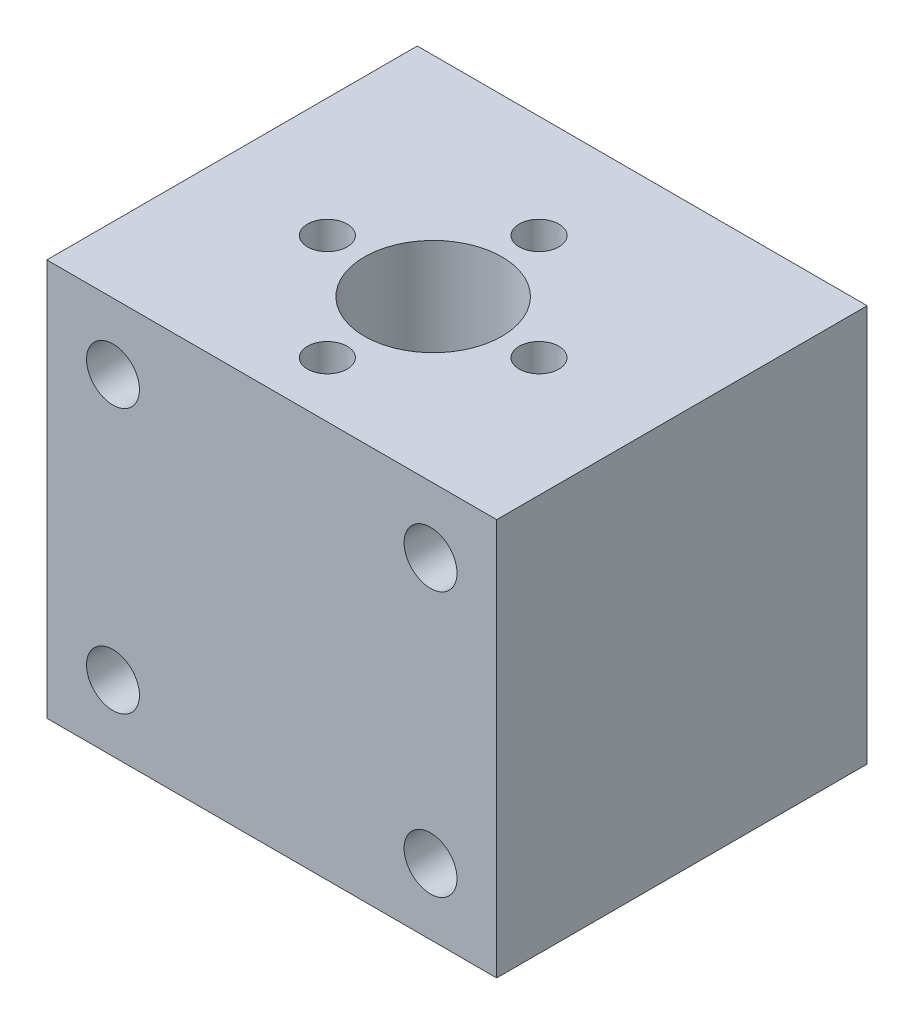
ISO-10303-21;
HEADER;
FILE_DESCRIPTION(('STEP AP214'),'2;1');
FILE_NAME('part.step','',(''),(''),'','','');
FILE_SCHEMA(('AUTOMOTIVE_DESIGN { 1 0 10303 214 1 1 1 1 }'));
ENDSEC;
DATA;
#1=APPLICATION_CONTEXT('core data for automotive mechanical design processes');
#2=APPLICATION_PROTOCOL_DEFINITION('international standard','automotive_design',2000,#1);
#3=PRODUCT_CONTEXT('',#1,'mechanical');
#4=PRODUCT('Part','Part','',(#3));
#5=PRODUCT_RELATED_PRODUCT_CATEGORY('part','',(#4));
#6=PRODUCT_DEFINITION_FORMATION('','',#4);
#7=PRODUCT_DEFINITION_CONTEXT('part definition',#1,'design');
#8=PRODUCT_DEFINITION('design','',#6,#7);
#9=PRODUCT_DEFINITION_SHAPE('','',#8);
#10=(LENGTH_UNIT() NAMED_UNIT(*) SI_UNIT(.MILLI.,.METRE.));
#11=(NAMED_UNIT(*) PLANE_ANGLE_UNIT() SI_UNIT($,.RADIAN.));
#12=(NAMED_UNIT(*) SI_UNIT($,.STERADIAN.) SOLID_ANGLE_UNIT());
#13=UNCERTAINTY_MEASURE_WITH_UNIT(LENGTH_MEASURE(1.E-05),#10,'distance_accuracy_value','');
#14=(GEOMETRIC_REPRESENTATION_CONTEXT(3) GLOBAL_UNCERTAINTY_ASSIGNED_CONTEXT((#13)) GLOBAL_UNIT_ASSIGNED_CONTEXT((#10,
#11,#12)) REPRESENTATION_CONTEXT('',''));
#15=CARTESIAN_POINT('',(0.,0.,0.));
#16=DIRECTION('',(0.,0.,1.));
#17=DIRECTION('',(1.,0.,0.));
#18=AXIS2_PLACEMENT_3D('',#15,#16,#17);
#19=CARTESIAN_POINT('',(-16.3119869221513,9.86014711151592,-28.));
#20=DIRECTION('',(-1.,0.,0.));
#21=DIRECTION('',(0.,-1.,0.));
#22=AXIS2_PLACEMENT_3D('',#19,#20,#21);
#23=PLANE('',#22);
#24=DIRECTION('',(0.,-1.,0.));
#25=VECTOR('',#24,1.);
#26=CARTESIAN_POINT('',(-16.3119869221513,9.86014711151592,0.));
#27=LINE('',#26,#25);
#28=CARTESIAN_POINT('',(-16.3119869221513,9.86014711151592,0.));
#29=VERTEX_POINT('',#28);
#30=CARTESIAN_POINT('',(-16.3119869221512,-20.1398528884841,0.));
#31=VERTEX_POINT('',#30);
#32=EDGE_CURVE('E102',#29,#31,#27,.T.);
#33=ORIENTED_EDGE('',*,*,#32,.F.);
#34=DIRECTION('',(0.,0.,1.));
#35=VECTOR('',#34,1.);
#36=CARTESIAN_POINT('',(-16.3119869221513,9.86014711151592,-28.));
#37=LINE('',#36,#35);
#38=CARTESIAN_POINT('',(-16.3119869221513,9.86014711151592,-28.));
#39=VERTEX_POINT('',#38);
#40=EDGE_CURVE('E11',#39,#29,#37,.T.);
#41=ORIENTED_EDGE('',*,*,#40,.F.);
#42=DIRECTION('',(0.,-1.,0.));
#43=VECTOR('',#42,1.);
#44=CARTESIAN_POINT('',(-16.3119869221513,9.86014711151592,-28.));
#45=LINE('',#44,#43);
#46=CARTESIAN_POINT('',(-16.3119869221512,-20.1398528884841,-28.));
#47=VERTEX_POINT('',#46);
#48=EDGE_CURVE('E95',#39,#47,#45,.T.);
#49=ORIENTED_EDGE('',*,*,#48,.T.);
#50=DIRECTION('',(0.,0.,1.));
#51=VECTOR('',#50,1.);
#52=CARTESIAN_POINT('',(-16.3119869221512,-20.1398528884841,-28.));
#53=LINE('',#52,#51);
#54=EDGE_CURVE('E40',#47,#31,#53,.T.);
#55=ORIENTED_EDGE('',*,*,#54,.T.);
#56=EDGE_LOOP('',(#33,#41,#49,#55));
#57=FACE_BOUND('',#56,.T.);
#58=ADVANCED_FACE('F37',(#57),#23,.T.);
#59=CARTESIAN_POINT('',(-16.3119869221513,9.86014711151592,-28.));
#60=DIRECTION('',(0.,1.,0.));
#61=DIRECTION('',(0.,0.,1.));
#62=AXIS2_PLACEMENT_3D('',#59,#60,#61);
#63=PLANE('',#62);
#64=CARTESIAN_POINT('',(0.688013077848743,9.86014711151592,-4.2));
#65=DIRECTION('',(0.,1.,0.));
#66=DIRECTION('',(0.,0.,1.));
#67=AXIS2_PLACEMENT_3D('',#64,#65,#66);
#68=CIRCLE('',#67,1.5);
#69=CARTESIAN_POINT('',(0.688013077848743,9.86014711151592,-2.7));
#70=VERTEX_POINT('',#69);
#71=EDGE_CURVE('E382',#70,#70,#68,.T.);
#72=ORIENTED_EDGE('',*,*,#71,.F.);
#73=EDGE_LOOP('',(#72));
#74=FACE_BOUND('',#73,.T.);
#75=CARTESIAN_POINT('',(8.68801307784874,9.86014711151592,-12.2));
#76=DIRECTION('',(0.,1.,0.));
#77=DIRECTION('',(0.,0.,1.));
#78=AXIS2_PLACEMENT_3D('',#75,#76,#77);
#79=CIRCLE('',#78,1.5);
#80=CARTESIAN_POINT('',(8.68801307784874,9.86014711151592,-10.7));
#81=VERTEX_POINT('',#80);
#82=EDGE_CURVE('E390',#81,#81,#79,.T.);
#83=ORIENTED_EDGE('',*,*,#82,.F.);
#84=EDGE_LOOP('',(#83));
#85=FACE_BOUND('',#84,.T.);
#86=CARTESIAN_POINT('',(0.688013077848743,9.86014711151592,-20.2));
#87=DIRECTION('',(0.,1.,0.));
#88=DIRECTION('',(0.,0.,1.));
#89=AXIS2_PLACEMENT_3D('',#86,#87,#88);
#90=CIRCLE('',#89,1.5);
#91=CARTESIAN_POINT('',(0.688013077848743,9.86014711151592,-18.7));
#92=VERTEX_POINT('',#91);
#93=EDGE_CURVE('E396',#92,#92,#90,.T.);
#94=ORIENTED_EDGE('',*,*,#93,.F.);
#95=EDGE_LOOP('',(#94));
#96=FACE_BOUND('',#95,.T.);
#97=CARTESIAN_POINT('',(-7.31198692215126,9.86014711151592,-12.2));
#98=DIRECTION('',(0.,1.,0.));
#99=DIRECTION('',(0.,0.,1.));
#100=AXIS2_PLACEMENT_3D('',#97,#98,#99);
#101=CIRCLE('',#100,1.5);
#102=CARTESIAN_POINT('',(-7.31198692215126,9.86014711151592,-10.7));
#103=VERTEX_POINT('',#102);
#104=EDGE_CURVE('E145',#103,#103,#101,.T.);
#105=ORIENTED_EDGE('',*,*,#104,.F.);
#106=EDGE_LOOP('',(#105));
#107=FACE_BOUND('',#106,.T.);
#108=CARTESIAN_POINT('',(0.688013077848743,9.86014711151592,-12.2));
#109=DIRECTION('',(0.,1.,0.));
#110=DIRECTION('',(0.,0.,1.));
#111=AXIS2_PLACEMENT_3D('',#108,#109,#110);
#112=CIRCLE('',#111,5.2);
#113=CARTESIAN_POINT('',(0.688013077848743,9.86014711151592,-7.));
#114=VERTEX_POINT('',#113);
#115=EDGE_CURVE('E136',#114,#114,#112,.T.);
#116=ORIENTED_EDGE('',*,*,#115,.F.);
#117=EDGE_LOOP('',(#116));
#118=FACE_BOUND('',#117,.T.);
#119=DIRECTION('',(-1.,0.,0.));
#120=VECTOR('',#119,1.);
#121=CARTESIAN_POINT('',(-16.3119869221513,9.86014711151592,0.));
#122=LINE('',#121,#120);
#123=CARTESIAN_POINT('',(17.6880130778488,9.86014711151592,0.));
#124=VERTEX_POINT('',#123);
#125=EDGE_CURVE('E97',#124,#29,#122,.T.);
#126=ORIENTED_EDGE('',*,*,#125,.F.);
#127=DIRECTION('',(0.,0.,1.));
#128=VECTOR('',#127,1.);
#129=CARTESIAN_POINT('',(17.6880130778488,9.86014711151592,-28.));
#130=LINE('',#129,#128);
#131=CARTESIAN_POINT('',(17.6880130778488,9.86014711151592,-28.));
#132=VERTEX_POINT('',#131);
#133=EDGE_CURVE('E46',#132,#124,#130,.T.);
#134=ORIENTED_EDGE('',*,*,#133,.F.);
#135=DIRECTION('',(-1.,0.,0.));
#136=VECTOR('',#135,1.);
#137=CARTESIAN_POINT('',(-16.3119869221513,9.86014711151592,-28.));
#138=LINE('',#137,#136);
#139=EDGE_CURVE('E92',#132,#39,#138,.T.);
#140=ORIENTED_EDGE('',*,*,#139,.T.);
#141=ORIENTED_EDGE('',*,*,#40,.T.);
#142=EDGE_LOOP('',(#126,#134,#140,#141));
#143=FACE_BOUND('',#142,.T.);
#144=ADVANCED_FACE('F113',(#74,#85,#96,#107,#118,#143),#63,.T.);
#145=CARTESIAN_POINT('',(17.6880130778488,9.86014711151592,-28.));
#146=DIRECTION('',(1.,0.,0.));
#147=DIRECTION('',(0.,1.,0.));
#148=AXIS2_PLACEMENT_3D('',#145,#146,#147);
#149=PLANE('',#148);
#150=DIRECTION('',(0.,1.,0.));
#151=VECTOR('',#150,1.);
#152=CARTESIAN_POINT('',(17.6880130778488,9.86014711151592,0.));
#153=LINE('',#152,#151);
#154=CARTESIAN_POINT('',(17.6880130778488,-20.1398528884841,0.));
#155=VERTEX_POINT('',#154);
#156=EDGE_CURVE('E87',#155,#124,#153,.T.);
#157=ORIENTED_EDGE('',*,*,#156,.F.);
#158=DIRECTION('',(0.,0.,1.));
#159=VECTOR('',#158,1.);
#160=CARTESIAN_POINT('',(17.6880130778488,-20.1398528884841,-28.));
#161=LINE('',#160,#159);
#162=CARTESIAN_POINT('',(17.6880130778488,-20.1398528884841,-28.));
#163=VERTEX_POINT('',#162);
#164=EDGE_CURVE('E82',#163,#155,#161,.T.);
#165=ORIENTED_EDGE('',*,*,#164,.F.);
#166=DIRECTION('',(0.,1.,0.));
#167=VECTOR('',#166,1.);
#168=CARTESIAN_POINT('',(17.6880130778488,9.86014711151592,-28.));
#169=LINE('',#168,#167);
#170=EDGE_CURVE('E85',#163,#132,#169,.T.);
#171=ORIENTED_EDGE('',*,*,#170,.T.);
#172=ORIENTED_EDGE('',*,*,#133,.T.);
#173=EDGE_LOOP('',(#157,#165,#171,#172));
#174=FACE_BOUND('',#173,.T.);
#175=ADVANCED_FACE('F84',(#174),#149,.T.);
#176=CARTESIAN_POINT('',(-16.3119869221512,-20.1398528884841,-28.));
#177=DIRECTION('',(0.,-1.,0.));
#178=DIRECTION('',(0.,0.,-1.));
#179=AXIS2_PLACEMENT_3D('',#176,#177,#178);
#180=PLANE('',#179);
#181=CARTESIAN_POINT('',(0.688013077848743,-20.1398528884841,-12.2));
#182=DIRECTION('',(0.,1.,0.));
#183=DIRECTION('',(0.,0.,1.));
#184=AXIS2_PLACEMENT_3D('',#181,#182,#183);
#185=CIRCLE('',#184,5.2);
#186=CARTESIAN_POINT('',(0.688013077848743,-20.1398528884841,-7.));
#187=VERTEX_POINT('',#186);
#188=EDGE_CURVE('E133',#187,#187,#185,.T.);
#189=ORIENTED_EDGE('',*,*,#188,.T.);
#190=EDGE_LOOP('',(#189));
#191=FACE_BOUND('',#190,.T.);
#192=DIRECTION('',(1.,0.,0.));
#193=VECTOR('',#192,1.);
#194=CARTESIAN_POINT('',(-16.3119869221512,-20.1398528884841,0.));
#195=LINE('',#194,#193);
#196=EDGE_CURVE('E105',#31,#155,#195,.T.);
#197=ORIENTED_EDGE('',*,*,#196,.F.);
#198=ORIENTED_EDGE('',*,*,#54,.F.);
#199=DIRECTION('',(1.,0.,0.));
#200=VECTOR('',#199,1.);
#201=CARTESIAN_POINT('',(-16.3119869221512,-20.1398528884841,-28.));
#202=LINE('',#201,#200);
#203=EDGE_CURVE('E91',#47,#163,#202,.T.);
#204=ORIENTED_EDGE('',*,*,#203,.T.);
#205=ORIENTED_EDGE('',*,*,#164,.T.);
#206=EDGE_LOOP('',(#197,#198,#204,#205));
#207=FACE_BOUND('',#206,.T.);
#208=ADVANCED_FACE('F94',(#191,#207),#180,.T.);
#209=CARTESIAN_POINT('',(0.,0.,-28.));
#210=DIRECTION('',(0.,0.,1.));
#211=DIRECTION('',(1.,0.,0.));
#212=AXIS2_PLACEMENT_3D('',#209,#210,#211);
#213=PLANE('',#212);
#214=ORIENTED_EDGE('',*,*,#48,.F.);
#215=ORIENTED_EDGE('',*,*,#139,.F.);
#216=ORIENTED_EDGE('',*,*,#170,.F.);
#217=ORIENTED_EDGE('',*,*,#203,.F.);
#218=EDGE_LOOP('',(#214,#215,#216,#217));
#219=FACE_BOUND('',#218,.T.);
#220=ADVANCED_FACE('F90',(#219),#213,.F.);
#221=CARTESIAN_POINT('',(0.,0.,0.));
#222=DIRECTION('',(0.,0.,1.));
#223=DIRECTION('',(1.,0.,0.));
#224=AXIS2_PLACEMENT_3D('',#221,#222,#223);
#225=PLANE('',#224);
#226=CARTESIAN_POINT('',(-11.3119869221512,-15.13985289,0.));
#227=DIRECTION('',(0.,0.,1.));
#228=DIRECTION('',(1.,0.,0.));
#229=AXIS2_PLACEMENT_3D('',#226,#227,#228);
#230=CIRCLE('',#229,2.);
#231=CARTESIAN_POINT('',(-9.31198692215125,-15.13985289,0.));
#232=VERTEX_POINT('',#231);
#233=EDGE_CURVE('E135',#232,#232,#230,.T.);
#234=ORIENTED_EDGE('',*,*,#233,.F.);
#235=EDGE_LOOP('',(#234));
#236=FACE_BOUND('',#235,.T.);
#237=CARTESIAN_POINT('',(12.6880130778488,-15.13985289,0.));
#238=DIRECTION('',(0.,0.,1.));
#239=DIRECTION('',(1.,0.,0.));
#240=AXIS2_PLACEMENT_3D('',#237,#238,#239);
#241=CIRCLE('',#240,2.);
#242=CARTESIAN_POINT('',(14.6880130778488,-15.13985289,0.));
#243=VERTEX_POINT('',#242);
#244=EDGE_CURVE('E158',#243,#243,#241,.T.);
#245=ORIENTED_EDGE('',*,*,#244,.F.);
#246=EDGE_LOOP('',(#245));
#247=FACE_BOUND('',#246,.T.);
#248=CARTESIAN_POINT('',(12.6880130778487,4.86014711,0.));
#249=DIRECTION('',(0.,0.,1.));
#250=DIRECTION('',(1.,0.,0.));
#251=AXIS2_PLACEMENT_3D('',#248,#249,#250);
#252=CIRCLE('',#251,2.);
#253=CARTESIAN_POINT('',(14.6880130778487,4.86014711,0.));
#254=VERTEX_POINT('',#253);
#255=EDGE_CURVE('E152',#254,#254,#252,.T.);
#256=ORIENTED_EDGE('',*,*,#255,.F.);
#257=EDGE_LOOP('',(#256));
#258=FACE_BOUND('',#257,.T.);
#259=CARTESIAN_POINT('',(-11.3119869221513,4.86014711,0.));
#260=DIRECTION('',(0.,0.,1.));
#261=DIRECTION('',(1.,0.,0.));
#262=AXIS2_PLACEMENT_3D('',#259,#260,#261);
#263=CIRCLE('',#262,2.);
#264=CARTESIAN_POINT('',(-9.31198692215125,4.86014711,0.));
#265=VERTEX_POINT('',#264);
#266=EDGE_CURVE('E151',#265,#265,#263,.T.);
#267=ORIENTED_EDGE('',*,*,#266,.F.);
#268=EDGE_LOOP('',(#267));
#269=FACE_BOUND('',#268,.T.);
#270=ORIENTED_EDGE('',*,*,#32,.T.);
#271=ORIENTED_EDGE('',*,*,#196,.T.);
#272=ORIENTED_EDGE('',*,*,#156,.T.);
#273=ORIENTED_EDGE('',*,*,#125,.T.);
#274=EDGE_LOOP('',(#270,#271,#272,#273));
#275=FACE_BOUND('',#274,.T.);
#276=ADVANCED_FACE('F112',(#236,#247,#258,#269,#275),#225,.T.);
#277=CARTESIAN_POINT('',(-11.3119869221513,4.86014711,-7.));
#278=DIRECTION('',(0.,0.,1.));
#279=DIRECTION('',(1.,0.,0.));
#280=AXIS2_PLACEMENT_3D('',#277,#278,#279);
#281=CYLINDRICAL_SURFACE('',#280,2.);
#282=CARTESIAN_POINT('',(-11.3119869221513,4.86014711,-7.));
#283=DIRECTION('',(0.,0.,1.));
#284=DIRECTION('',(1.,0.,0.));
#285=AXIS2_PLACEMENT_3D('',#282,#283,#284);
#286=CIRCLE('',#285,2.);
#287=CARTESIAN_POINT('',(-9.31198692215125,4.86014711,-7.));
#288=VERTEX_POINT('',#287);
#289=EDGE_CURVE('E106',#288,#288,#286,.T.);
#290=ORIENTED_EDGE('',*,*,#289,.F.);
#291=EDGE_LOOP('',(#290));
#292=FACE_BOUND('',#291,.T.);
#293=ORIENTED_EDGE('',*,*,#266,.T.);
#294=EDGE_LOOP('',(#293));
#295=FACE_BOUND('',#294,.T.);
#296=ADVANCED_FACE('F167',(#292,#295),#281,.F.);
#297=CARTESIAN_POINT('',(-11.3119869221513,4.86014711,-7.));
#298=DIRECTION('',(0.,0.,1.));
#299=DIRECTION('',(1.,0.,0.));
#300=AXIS2_PLACEMENT_3D('',#297,#298,#299);
#301=PLANE('',#300);
#302=ORIENTED_EDGE('',*,*,#289,.T.);
#303=EDGE_LOOP('',(#302));
#304=FACE_BOUND('',#303,.T.);
#305=ADVANCED_FACE('F174',(#304),#301,.T.);
#306=CARTESIAN_POINT('',(12.6880130778487,4.86014711,-7.));
#307=DIRECTION('',(0.,0.,1.));
#308=DIRECTION('',(1.,0.,0.));
#309=AXIS2_PLACEMENT_3D('',#306,#307,#308);
#310=CYLINDRICAL_SURFACE('',#309,2.);
#311=CARTESIAN_POINT('',(12.6880130778487,4.86014711,-7.));
#312=DIRECTION('',(0.,0.,1.));
#313=DIRECTION('',(1.,0.,0.));
#314=AXIS2_PLACEMENT_3D('',#311,#312,#313);
#315=CIRCLE('',#314,2.);
#316=CARTESIAN_POINT('',(14.6880130778487,4.86014711,-7.));
#317=VERTEX_POINT('',#316);
#318=EDGE_CURVE('E148',#317,#317,#315,.T.);
#319=ORIENTED_EDGE('',*,*,#318,.F.);
#320=EDGE_LOOP('',(#319));
#321=FACE_BOUND('',#320,.T.);
#322=ORIENTED_EDGE('',*,*,#255,.T.);
#323=EDGE_LOOP('',(#322));
#324=FACE_BOUND('',#323,.T.);
#325=ADVANCED_FACE('F183',(#321,#324),#310,.F.);
#326=CARTESIAN_POINT('',(12.6880130778487,4.86014711,-7.));
#327=DIRECTION('',(0.,0.,1.));
#328=DIRECTION('',(1.,0.,0.));
#329=AXIS2_PLACEMENT_3D('',#326,#327,#328);
#330=PLANE('',#329);
#331=ORIENTED_EDGE('',*,*,#318,.T.);
#332=EDGE_LOOP('',(#331));
#333=FACE_BOUND('',#332,.T.);
#334=ADVANCED_FACE('F185',(#333),#330,.T.);
#335=CARTESIAN_POINT('',(12.6880130778488,-15.13985289,-7.));
#336=DIRECTION('',(0.,0.,1.));
#337=DIRECTION('',(1.,0.,0.));
#338=AXIS2_PLACEMENT_3D('',#335,#336,#337);
#339=CYLINDRICAL_SURFACE('',#338,2.);
#340=CARTESIAN_POINT('',(12.6880130778488,-15.13985289,-7.));
#341=DIRECTION('',(0.,0.,1.));
#342=DIRECTION('',(1.,0.,0.));
#343=AXIS2_PLACEMENT_3D('',#340,#341,#342);
#344=CIRCLE('',#343,2.);
#345=CARTESIAN_POINT('',(14.6880130778488,-15.13985289,-7.));
#346=VERTEX_POINT('',#345);
#347=EDGE_CURVE('E155',#346,#346,#344,.T.);
#348=ORIENTED_EDGE('',*,*,#347,.F.);
#349=EDGE_LOOP('',(#348));
#350=FACE_BOUND('',#349,.T.);
#351=ORIENTED_EDGE('',*,*,#244,.T.);
#352=EDGE_LOOP('',(#351));
#353=FACE_BOUND('',#352,.T.);
#354=ADVANCED_FACE('F192',(#350,#353),#339,.F.);
#355=CARTESIAN_POINT('',(12.6880130778488,-15.13985289,-7.));
#356=DIRECTION('',(0.,0.,1.));
#357=DIRECTION('',(1.,0.,0.));
#358=AXIS2_PLACEMENT_3D('',#355,#356,#357);
#359=PLANE('',#358);
#360=ORIENTED_EDGE('',*,*,#347,.T.);
#361=EDGE_LOOP('',(#360));
#362=FACE_BOUND('',#361,.T.);
#363=ADVANCED_FACE('F200',(#362),#359,.T.);
#364=CARTESIAN_POINT('',(-11.3119869221512,-15.13985289,-7.));
#365=DIRECTION('',(0.,0.,1.));
#366=DIRECTION('',(1.,0.,0.));
#367=AXIS2_PLACEMENT_3D('',#364,#365,#366);
#368=CYLINDRICAL_SURFACE('',#367,2.);
#369=CARTESIAN_POINT('',(-11.3119869221512,-15.13985289,-7.));
#370=DIRECTION('',(0.,0.,1.));
#371=DIRECTION('',(1.,0.,0.));
#372=AXIS2_PLACEMENT_3D('',#369,#370,#371);
#373=CIRCLE('',#372,2.);
#374=CARTESIAN_POINT('',(-9.31198692215125,-15.13985289,-7.));
#375=VERTEX_POINT('',#374);
#376=EDGE_CURVE('E139',#375,#375,#373,.T.);
#377=ORIENTED_EDGE('',*,*,#376,.F.);
#378=EDGE_LOOP('',(#377));
#379=FACE_BOUND('',#378,.T.);
#380=ORIENTED_EDGE('',*,*,#233,.T.);
#381=EDGE_LOOP('',(#380));
#382=FACE_BOUND('',#381,.T.);
#383=ADVANCED_FACE('F203',(#379,#382),#368,.F.);
#384=CARTESIAN_POINT('',(-11.3119869221512,-15.13985289,-7.));
#385=DIRECTION('',(0.,0.,1.));
#386=DIRECTION('',(1.,0.,0.));
#387=AXIS2_PLACEMENT_3D('',#384,#385,#386);
#388=PLANE('',#387);
#389=ORIENTED_EDGE('',*,*,#376,.T.);
#390=EDGE_LOOP('',(#389));
#391=FACE_BOUND('',#390,.T.);
#392=ADVANCED_FACE('F208',(#391),#388,.T.);
#393=CARTESIAN_POINT('',(0.688013077848743,-20.1398528884841,-12.2));
#394=DIRECTION('',(0.,1.,0.));
#395=DIRECTION('',(0.,0.,1.));
#396=AXIS2_PLACEMENT_3D('',#393,#394,#395);
#397=CYLINDRICAL_SURFACE('',#396,5.2);
#398=ORIENTED_EDGE('',*,*,#188,.F.);
#399=EDGE_LOOP('',(#398));
#400=FACE_BOUND('',#399,.T.);
#401=ORIENTED_EDGE('',*,*,#115,.T.);
#402=EDGE_LOOP('',(#401));
#403=FACE_BOUND('',#402,.T.);
#404=ADVANCED_FACE('F211',(#400,#403),#397,.F.);
#405=CARTESIAN_POINT('',(-7.31198692215126,2.86014711151592,-12.2));
#406=DIRECTION('',(0.,1.,0.));
#407=DIRECTION('',(0.,0.,1.));
#408=AXIS2_PLACEMENT_3D('',#405,#406,#407);
#409=CYLINDRICAL_SURFACE('',#408,1.5);
#410=CARTESIAN_POINT('',(-7.31198692215126,2.86014711151592,-12.2));
#411=DIRECTION('',(0.,1.,0.));
#412=DIRECTION('',(0.,0.,1.));
#413=AXIS2_PLACEMENT_3D('',#410,#411,#412);
#414=CIRCLE('',#413,1.5);
#415=CARTESIAN_POINT('',(-7.31198692215126,2.86014711151592,-10.7));
#416=VERTEX_POINT('',#415);
#417=EDGE_CURVE('E398',#416,#416,#414,.T.);
#418=ORIENTED_EDGE('',*,*,#417,.F.);
#419=EDGE_LOOP('',(#418));
#420=FACE_BOUND('',#419,.T.);
#421=ORIENTED_EDGE('',*,*,#104,.T.);
#422=EDGE_LOOP('',(#421));
#423=FACE_BOUND('',#422,.T.);
#424=ADVANCED_FACE('F231',(#420,#423),#409,.F.);
#425=CARTESIAN_POINT('',(-7.31198692215126,2.86014711151592,-12.2));
#426=DIRECTION('',(0.,1.,0.));
#427=DIRECTION('',(0.,0.,1.));
#428=AXIS2_PLACEMENT_3D('',#425,#426,#427);
#429=PLANE('',#428);
#430=ORIENTED_EDGE('',*,*,#417,.T.);
#431=EDGE_LOOP('',(#430));
#432=FACE_BOUND('',#431,.T.);
#433=ADVANCED_FACE('F237',(#432),#429,.T.);
#434=CARTESIAN_POINT('',(0.688013077848743,2.86014711151592,-20.2));
#435=DIRECTION('',(0.,1.,0.));
#436=DIRECTION('',(0.,0.,1.));
#437=AXIS2_PLACEMENT_3D('',#434,#435,#436);
#438=CYLINDRICAL_SURFACE('',#437,1.5);
#439=CARTESIAN_POINT('',(0.688013077848743,2.86014711151592,-20.2));
#440=DIRECTION('',(0.,1.,0.));
#441=DIRECTION('',(0.,0.,1.));
#442=AXIS2_PLACEMENT_3D('',#439,#440,#441);
#443=CIRCLE('',#442,1.5);
#444=CARTESIAN_POINT('',(0.688013077848743,2.86014711151592,-18.7));
#445=VERTEX_POINT('',#444);
#446=EDGE_CURVE('E393',#445,#445,#443,.T.);
#447=ORIENTED_EDGE('',*,*,#446,.F.);
#448=EDGE_LOOP('',(#447));
#449=FACE_BOUND('',#448,.T.);
#450=ORIENTED_EDGE('',*,*,#93,.T.);
#451=EDGE_LOOP('',(#450));
#452=FACE_BOUND('',#451,.T.);
#453=ADVANCED_FACE('F245',(#449,#452),#438,.F.);
#454=CARTESIAN_POINT('',(0.688013077848743,2.86014711151592,-20.2));
#455=DIRECTION('',(0.,1.,0.));
#456=DIRECTION('',(0.,0.,1.));
#457=AXIS2_PLACEMENT_3D('',#454,#455,#456);
#458=PLANE('',#457);
#459=ORIENTED_EDGE('',*,*,#446,.T.);
#460=EDGE_LOOP('',(#459));
#461=FACE_BOUND('',#460,.T.);
#462=ADVANCED_FACE('F253',(#461),#458,.T.);
#463=CARTESIAN_POINT('',(8.68801307784874,2.86014711151592,-12.2));
#464=DIRECTION('',(0.,1.,0.));
#465=DIRECTION('',(0.,0.,1.));
#466=AXIS2_PLACEMENT_3D('',#463,#464,#465);
#467=CYLINDRICAL_SURFACE('',#466,1.5);
#468=CARTESIAN_POINT('',(8.68801307784874,2.86014711151592,-12.2));
#469=DIRECTION('',(0.,1.,0.));
#470=DIRECTION('',(0.,0.,1.));
#471=AXIS2_PLACEMENT_3D('',#468,#469,#470);
#472=CIRCLE('',#471,1.5);
#473=CARTESIAN_POINT('',(8.68801307784874,2.86014711151592,-10.7));
#474=VERTEX_POINT('',#473);
#475=EDGE_CURVE('E385',#474,#474,#472,.T.);
#476=ORIENTED_EDGE('',*,*,#475,.F.);
#477=EDGE_LOOP('',(#476));
#478=FACE_BOUND('',#477,.T.);
#479=ORIENTED_EDGE('',*,*,#82,.T.);
#480=EDGE_LOOP('',(#479));
#481=FACE_BOUND('',#480,.T.);
#482=ADVANCED_FACE('F261',(#478,#481),#467,.F.);
#483=CARTESIAN_POINT('',(8.68801307784874,2.86014711151592,-12.2));
#484=DIRECTION('',(0.,1.,0.));
#485=DIRECTION('',(0.,0.,1.));
#486=AXIS2_PLACEMENT_3D('',#483,#484,#485);
#487=PLANE('',#486);
#488=ORIENTED_EDGE('',*,*,#475,.T.);
#489=EDGE_LOOP('',(#488));
#490=FACE_BOUND('',#489,.T.);
#491=ADVANCED_FACE('F269',(#490),#487,.T.);
#492=CARTESIAN_POINT('',(0.688013077848743,2.86014711151592,-4.2));
#493=DIRECTION('',(0.,1.,0.));
#494=DIRECTION('',(0.,0.,1.));
#495=AXIS2_PLACEMENT_3D('',#492,#493,#494);
#496=CYLINDRICAL_SURFACE('',#495,1.5);
#497=CARTESIAN_POINT('',(0.688013077848743,2.86014711151592,-4.2));
#498=DIRECTION('',(0.,1.,0.));
#499=DIRECTION('',(0.,0.,1.));
#500=AXIS2_PLACEMENT_3D('',#497,#498,#499);
#501=CIRCLE('',#500,1.5);
#502=CARTESIAN_POINT('',(0.688013077848743,2.86014711151592,-2.7));
#503=VERTEX_POINT('',#502);
#504=EDGE_CURVE('E142',#503,#503,#501,.T.);
#505=ORIENTED_EDGE('',*,*,#504,.F.);
#506=EDGE_LOOP('',(#505));
#507=FACE_BOUND('',#506,.T.);
#508=ORIENTED_EDGE('',*,*,#71,.T.);
#509=EDGE_LOOP('',(#508));
#510=FACE_BOUND('',#509,.T.);
#511=ADVANCED_FACE('F277',(#507,#510),#496,.F.);
#512=CARTESIAN_POINT('',(0.688013077848743,2.86014711151592,-4.2));
#513=DIRECTION('',(0.,1.,0.));
#514=DIRECTION('',(0.,0.,1.));
#515=AXIS2_PLACEMENT_3D('',#512,#513,#514);
#516=PLANE('',#515);
#517=ORIENTED_EDGE('',*,*,#504,.T.);
#518=EDGE_LOOP('',(#517));
#519=FACE_BOUND('',#518,.T.);
#520=ADVANCED_FACE('F285',(#519),#516,.T.);
#521=CLOSED_SHELL('',(#58,#144,#175,#208,#220,#276,#296,#305,#325,#334,#354,#363,#383,#392,#404,
#424,#433,#453,#462,#482,#491,#511,#520));
#522=MANIFOLD_SOLID_BREP('B2',#521);
#523=ADVANCED_BREP_SHAPE_REPRESENTATION('',(#18,#522),#14);
#524=SHAPE_DEFINITION_REPRESENTATION(#9,#523);
ENDSEC;
END-ISO-10303-21;
